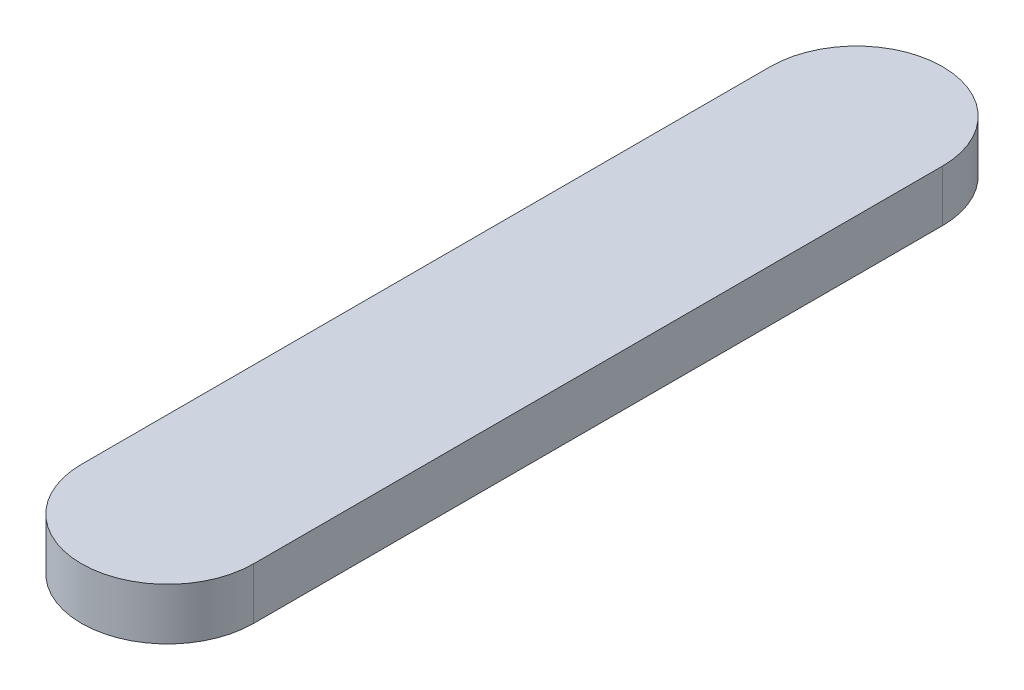
ISO-10303-21;
HEADER;
FILE_DESCRIPTION(('STEP AP214'),'2;1');
FILE_NAME('part.step','',(''),(''),'','','');
FILE_SCHEMA(('AUTOMOTIVE_DESIGN { 1 0 10303 214 1 1 1 1 }'));
ENDSEC;
DATA;
#1=APPLICATION_CONTEXT('core data for automotive mechanical design processes');
#2=APPLICATION_PROTOCOL_DEFINITION('international standard','automotive_design',2000,#1);
#3=PRODUCT_CONTEXT('',#1,'mechanical');
#4=PRODUCT('Part','Part','',(#3));
#5=PRODUCT_RELATED_PRODUCT_CATEGORY('part','',(#4));
#6=PRODUCT_DEFINITION_FORMATION('','',#4);
#7=PRODUCT_DEFINITION_CONTEXT('part definition',#1,'design');
#8=PRODUCT_DEFINITION('design','',#6,#7);
#9=PRODUCT_DEFINITION_SHAPE('','',#8);
#10=(LENGTH_UNIT() NAMED_UNIT(*) SI_UNIT(.MILLI.,.METRE.));
#11=(NAMED_UNIT(*) PLANE_ANGLE_UNIT() SI_UNIT($,.RADIAN.));
#12=(NAMED_UNIT(*) SI_UNIT($,.STERADIAN.) SOLID_ANGLE_UNIT());
#13=UNCERTAINTY_MEASURE_WITH_UNIT(LENGTH_MEASURE(1.E-05),#10,'distance_accuracy_value','');
#14=(GEOMETRIC_REPRESENTATION_CONTEXT(3) GLOBAL_UNCERTAINTY_ASSIGNED_CONTEXT((#13)) GLOBAL_UNIT_ASSIGNED_CONTEXT((#10,
#11,#12)) REPRESENTATION_CONTEXT('',''));
#15=CARTESIAN_POINT('',(0.,0.,0.));
#16=DIRECTION('',(0.,0.,1.));
#17=DIRECTION('',(1.,0.,0.));
#18=AXIS2_PLACEMENT_3D('',#15,#16,#17);
#19=CARTESIAN_POINT('',(0.,30.,-200.));
#20=DIRECTION('',(0.,-1.,0.));
#21=DIRECTION('',(0.,0.,-1.));
#22=AXIS2_PLACEMENT_3D('',#19,#20,#21);
#23=CYLINDRICAL_SURFACE('',#22,50.);
#24=CARTESIAN_POINT('',(0.,0.,-200.));
#25=DIRECTION('',(0.,1.,0.));
#26=DIRECTION('',(0.,0.,1.));
#27=AXIS2_PLACEMENT_3D('',#24,#25,#26);
#28=CIRCLE('',#27,50.);
#29=CARTESIAN_POINT('',(49.9999999999999,0.,-200.));
#30=VERTEX_POINT('',#29);
#31=CARTESIAN_POINT('',(-50.0000000000001,0.,-200.));
#32=VERTEX_POINT('',#31);
#33=EDGE_CURVE('E100',#30,#32,#28,.T.);
#34=ORIENTED_EDGE('',*,*,#33,.T.);
#35=DIRECTION('',(0.,-1.,0.));
#36=VECTOR('',#35,1.);
#37=CARTESIAN_POINT('',(-50.0000000000001,30.,-200.));
#38=LINE('',#37,#36);
#39=CARTESIAN_POINT('',(-50.0000000000001,30.,-200.));
#40=VERTEX_POINT('',#39);
#41=EDGE_CURVE('E11',#40,#32,#38,.T.);
#42=ORIENTED_EDGE('',*,*,#41,.F.);
#43=CARTESIAN_POINT('',(0.,30.,-200.));
#44=DIRECTION('',(0.,1.,0.));
#45=DIRECTION('',(0.,0.,1.));
#46=AXIS2_PLACEMENT_3D('',#43,#44,#45);
#47=CIRCLE('',#46,50.);
#48=CARTESIAN_POINT('',(49.9999999999999,30.,-200.));
#49=VERTEX_POINT('',#48);
#50=EDGE_CURVE('E88',#49,#40,#47,.T.);
#51=ORIENTED_EDGE('',*,*,#50,.F.);
#52=DIRECTION('',(0.,-1.,0.));
#53=VECTOR('',#52,1.);
#54=CARTESIAN_POINT('',(49.9999999999999,30.,-200.));
#55=LINE('',#54,#53);
#56=EDGE_CURVE('E96',#49,#30,#55,.T.);
#57=ORIENTED_EDGE('',*,*,#56,.T.);
#58=EDGE_LOOP('',(#34,#42,#51,#57));
#59=FACE_BOUND('',#58,.T.);
#60=ADVANCED_FACE('F37',(#59),#23,.T.);
#61=CARTESIAN_POINT('',(-50.0000000000001,30.,-200.));
#62=DIRECTION('',(1.,0.,0.));
#63=DIRECTION('',(0.,0.,-1.));
#64=AXIS2_PLACEMENT_3D('',#61,#62,#63);
#65=PLANE('',#64);
#66=DIRECTION('',(0.,0.,1.));
#67=VECTOR('',#66,1.);
#68=CARTESIAN_POINT('',(-50.0000000000001,0.,-200.));
#69=LINE('',#68,#67);
#70=CARTESIAN_POINT('',(-50.,0.,200.));
#71=VERTEX_POINT('',#70);
#72=EDGE_CURVE('E92',#32,#71,#69,.T.);
#73=ORIENTED_EDGE('',*,*,#72,.T.);
#74=DIRECTION('',(0.,-1.,0.));
#75=VECTOR('',#74,1.);
#76=CARTESIAN_POINT('',(-50.,30.,200.));
#77=LINE('',#76,#75);
#78=CARTESIAN_POINT('',(-50.,30.,200.));
#79=VERTEX_POINT('',#78);
#80=EDGE_CURVE('E45',#79,#71,#77,.T.);
#81=ORIENTED_EDGE('',*,*,#80,.F.);
#82=DIRECTION('',(0.,0.,1.));
#83=VECTOR('',#82,1.);
#84=CARTESIAN_POINT('',(-50.0000000000001,30.,-200.));
#85=LINE('',#84,#83);
#86=EDGE_CURVE('E83',#40,#79,#85,.T.);
#87=ORIENTED_EDGE('',*,*,#86,.F.);
#88=ORIENTED_EDGE('',*,*,#41,.T.);
#89=EDGE_LOOP('',(#73,#81,#87,#88));
#90=FACE_BOUND('',#89,.T.);
#91=ADVANCED_FACE('F91',(#90),#65,.F.);
#92=CARTESIAN_POINT('',(0.,30.,200.));
#93=DIRECTION('',(0.,-1.,0.));
#94=DIRECTION('',(0.,0.,-1.));
#95=AXIS2_PLACEMENT_3D('',#92,#93,#94);
#96=CYLINDRICAL_SURFACE('',#95,50.);
#97=CARTESIAN_POINT('',(0.,0.,200.));
#98=DIRECTION('',(0.,1.,0.));
#99=DIRECTION('',(0.,0.,1.));
#100=AXIS2_PLACEMENT_3D('',#97,#98,#99);
#101=CIRCLE('',#100,50.);
#102=CARTESIAN_POINT('',(50.,0.,200.));
#103=VERTEX_POINT('',#102);
#104=EDGE_CURVE('E70',#71,#103,#101,.T.);
#105=ORIENTED_EDGE('',*,*,#104,.T.);
#106=DIRECTION('',(0.,-1.,0.));
#107=VECTOR('',#106,1.);
#108=CARTESIAN_POINT('',(50.,30.,200.));
#109=LINE('',#108,#107);
#110=CARTESIAN_POINT('',(50.,30.,200.));
#111=VERTEX_POINT('',#110);
#112=EDGE_CURVE('E93',#111,#103,#109,.T.);
#113=ORIENTED_EDGE('',*,*,#112,.F.);
#114=CARTESIAN_POINT('',(0.,30.,200.));
#115=DIRECTION('',(0.,1.,0.));
#116=DIRECTION('',(0.,0.,1.));
#117=AXIS2_PLACEMENT_3D('',#114,#115,#116);
#118=CIRCLE('',#117,50.);
#119=EDGE_CURVE('E86',#79,#111,#118,.T.);
#120=ORIENTED_EDGE('',*,*,#119,.F.);
#121=ORIENTED_EDGE('',*,*,#80,.T.);
#122=EDGE_LOOP('',(#105,#113,#120,#121));
#123=FACE_BOUND('',#122,.T.);
#124=ADVANCED_FACE('F94',(#123),#96,.T.);
#125=CARTESIAN_POINT('',(49.9999999999999,30.,-200.));
#126=DIRECTION('',(-1.,0.,0.));
#127=DIRECTION('',(0.,0.,1.));
#128=AXIS2_PLACEMENT_3D('',#125,#126,#127);
#129=PLANE('',#128);
#130=DIRECTION('',(0.,0.,-1.));
#131=VECTOR('',#130,1.);
#132=CARTESIAN_POINT('',(49.9999999999999,0.,-200.));
#133=LINE('',#132,#131);
#134=EDGE_CURVE('E76',#103,#30,#133,.T.);
#135=ORIENTED_EDGE('',*,*,#134,.T.);
#136=ORIENTED_EDGE('',*,*,#56,.F.);
#137=DIRECTION('',(0.,0.,-1.));
#138=VECTOR('',#137,1.);
#139=CARTESIAN_POINT('',(49.9999999999999,30.,-200.));
#140=LINE('',#139,#138);
#141=EDGE_CURVE('E53',#111,#49,#140,.T.);
#142=ORIENTED_EDGE('',*,*,#141,.F.);
#143=ORIENTED_EDGE('',*,*,#112,.T.);
#144=EDGE_LOOP('',(#135,#136,#142,#143));
#145=FACE_BOUND('',#144,.T.);
#146=ADVANCED_FACE('F107',(#145),#129,.F.);
#147=CARTESIAN_POINT('',(0.,30.,-200.));
#148=DIRECTION('',(0.,1.,0.));
#149=DIRECTION('',(0.,0.,1.));
#150=AXIS2_PLACEMENT_3D('',#147,#148,#149);
#151=PLANE('',#150);
#152=ORIENTED_EDGE('',*,*,#50,.T.);
#153=ORIENTED_EDGE('',*,*,#86,.T.);
#154=ORIENTED_EDGE('',*,*,#119,.T.);
#155=ORIENTED_EDGE('',*,*,#141,.T.);
#156=EDGE_LOOP('',(#152,#153,#154,#155));
#157=FACE_BOUND('',#156,.T.);
#158=ADVANCED_FACE('F84',(#157),#151,.T.);
#159=CARTESIAN_POINT('',(0.,0.,-200.));
#160=DIRECTION('',(0.,1.,0.));
#161=DIRECTION('',(0.,0.,1.));
#162=AXIS2_PLACEMENT_3D('',#159,#160,#161);
#163=PLANE('',#162);
#164=ORIENTED_EDGE('',*,*,#33,.F.);
#165=ORIENTED_EDGE('',*,*,#134,.F.);
#166=ORIENTED_EDGE('',*,*,#104,.F.);
#167=ORIENTED_EDGE('',*,*,#72,.F.);
#168=EDGE_LOOP('',(#164,#165,#166,#167));
#169=FACE_BOUND('',#168,.T.);
#170=ADVANCED_FACE('F110',(#169),#163,.F.);
#171=CLOSED_SHELL('',(#60,#91,#124,#146,#158,#170));
#172=MANIFOLD_SOLID_BREP('B2',#171);
#173=ADVANCED_BREP_SHAPE_REPRESENTATION('',(#18,#172),#14);
#174=SHAPE_DEFINITION_REPRESENTATION(#9,#173);
ENDSEC;
END-ISO-10303-21;
